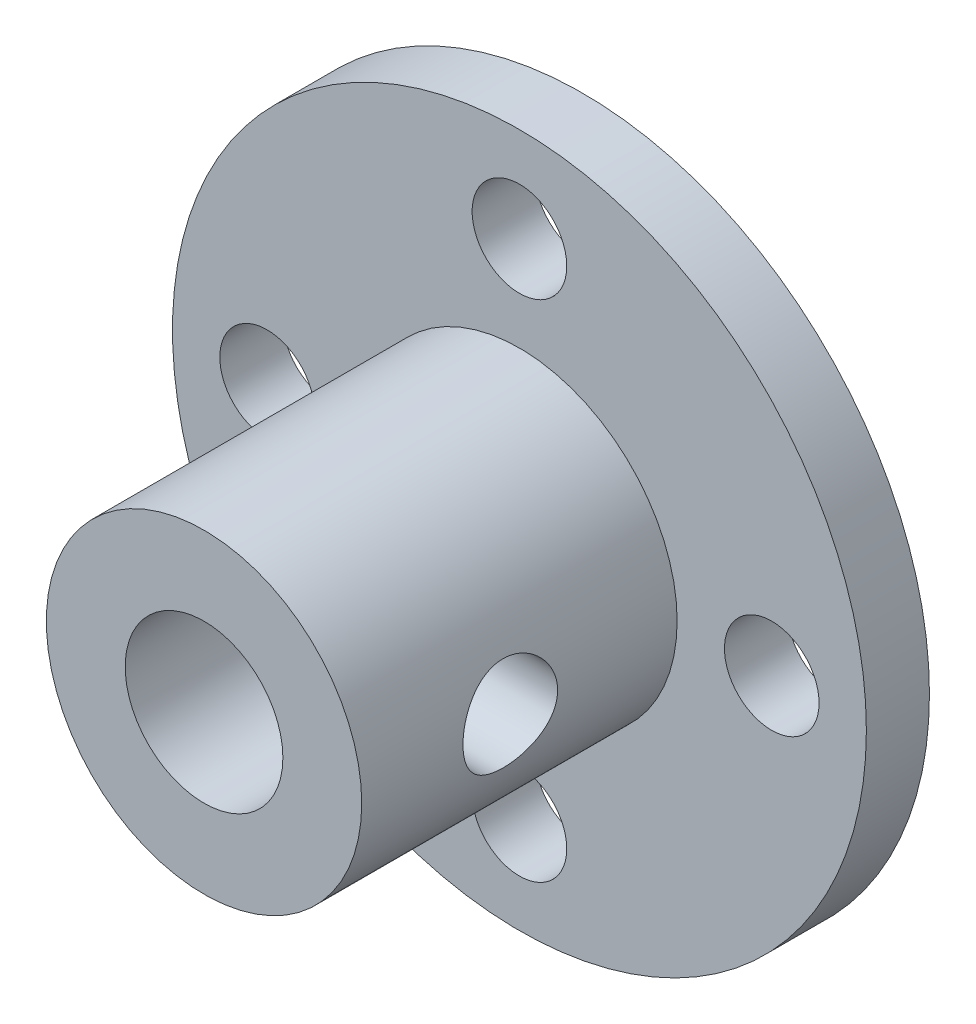
ISO-10303-21;
HEADER;
FILE_DESCRIPTION(('STEP AP214'),'2;1');
FILE_NAME('part.step','',(''),(''),'','','');
FILE_SCHEMA(('AUTOMOTIVE_DESIGN { 1 0 10303 214 1 1 1 1 }'));
ENDSEC;
DATA;
#1=APPLICATION_CONTEXT('core data for automotive mechanical design processes');
#2=APPLICATION_PROTOCOL_DEFINITION('international standard','automotive_design',2000,#1);
#3=PRODUCT_CONTEXT('',#1,'mechanical');
#4=PRODUCT('Part','Part','',(#3));
#5=PRODUCT_RELATED_PRODUCT_CATEGORY('part','',(#4));
#6=PRODUCT_DEFINITION_FORMATION('','',#4);
#7=PRODUCT_DEFINITION_CONTEXT('part definition',#1,'design');
#8=PRODUCT_DEFINITION('design','',#6,#7);
#9=PRODUCT_DEFINITION_SHAPE('','',#8);
#10=(LENGTH_UNIT() NAMED_UNIT(*) SI_UNIT(.MILLI.,.METRE.));
#11=(NAMED_UNIT(*) PLANE_ANGLE_UNIT() SI_UNIT($,.RADIAN.));
#12=(NAMED_UNIT(*) SI_UNIT($,.STERADIAN.) SOLID_ANGLE_UNIT());
#13=UNCERTAINTY_MEASURE_WITH_UNIT(LENGTH_MEASURE(1.E-05),#10,'distance_accuracy_value','');
#14=(GEOMETRIC_REPRESENTATION_CONTEXT(3) GLOBAL_UNCERTAINTY_ASSIGNED_CONTEXT((#13)) GLOBAL_UNIT_ASSIGNED_CONTEXT((#10,
#11,#12)) REPRESENTATION_CONTEXT('',''));
#15=CARTESIAN_POINT('',(0.,0.,0.));
#16=DIRECTION('',(0.,0.,1.));
#17=DIRECTION('',(1.,0.,0.));
#18=AXIS2_PLACEMENT_3D('',#15,#16,#17);
#19=CARTESIAN_POINT('',(0.,0.,2.));
#20=DIRECTION('',(0.,0.,-1.));
#21=DIRECTION('',(-1.,0.,0.));
#22=AXIS2_PLACEMENT_3D('',#19,#20,#21);
#23=CYLINDRICAL_SURFACE('',#22,11.);
#24=CARTESIAN_POINT('',(0.,0.,2.));
#25=DIRECTION('',(0.,0.,1.));
#26=DIRECTION('',(1.,0.,0.));
#27=AXIS2_PLACEMENT_3D('',#24,#25,#26);
#28=CIRCLE('',#27,11.);
#29=CARTESIAN_POINT('',(11.,0.,2.));
#30=VERTEX_POINT('',#29);
#31=EDGE_CURVE('E50',#30,#30,#28,.T.);
#32=ORIENTED_EDGE('',*,*,#31,.F.);
#33=EDGE_LOOP('',(#32));
#34=FACE_BOUND('',#33,.T.);
#35=CARTESIAN_POINT('',(0.,0.,0.));
#36=DIRECTION('',(0.,0.,1.));
#37=DIRECTION('',(1.,0.,0.));
#38=AXIS2_PLACEMENT_3D('',#35,#36,#37);
#39=CIRCLE('',#38,11.);
#40=CARTESIAN_POINT('',(11.,0.,0.));
#41=VERTEX_POINT('',#40);
#42=EDGE_CURVE('E56',#41,#41,#39,.T.);
#43=ORIENTED_EDGE('',*,*,#42,.T.);
#44=EDGE_LOOP('',(#43));
#45=FACE_BOUND('',#44,.T.);
#46=ADVANCED_FACE('F37',(#34,#45),#23,.T.);
#47=CARTESIAN_POINT('',(0.,0.,2.));
#48=DIRECTION('',(0.,0.,1.));
#49=DIRECTION('',(1.,0.,0.));
#50=AXIS2_PLACEMENT_3D('',#47,#48,#49);
#51=PLANE('',#50);
#52=CARTESIAN_POINT('',(0.,8.,2.));
#53=DIRECTION('',(0.,0.,1.));
#54=DIRECTION('',(1.,0.,0.));
#55=AXIS2_PLACEMENT_3D('',#52,#53,#54);
#56=CIRCLE('',#55,1.5);
#57=CARTESIAN_POINT('',(1.5,8.,2.));
#58=VERTEX_POINT('',#57);
#59=EDGE_CURVE('E163',#58,#58,#56,.T.);
#60=ORIENTED_EDGE('',*,*,#59,.F.);
#61=EDGE_LOOP('',(#60));
#62=FACE_BOUND('',#61,.T.);
#63=CARTESIAN_POINT('',(8.00000000000023,2.26393958003914E-13,2.));
#64=DIRECTION('',(0.,0.,1.));
#65=DIRECTION('',(1.,0.,0.));
#66=AXIS2_PLACEMENT_3D('',#63,#64,#65);
#67=CIRCLE('',#66,1.50000000000018);
#68=CARTESIAN_POINT('',(9.5000000000004,2.26393958003914E-13,2.));
#69=VERTEX_POINT('',#68);
#70=EDGE_CURVE('E155',#69,#69,#67,.T.);
#71=ORIENTED_EDGE('',*,*,#70,.F.);
#72=EDGE_LOOP('',(#71));
#73=FACE_BOUND('',#72,.T.);
#74=CARTESIAN_POINT('',(4.52787916007828E-13,-8.,2.));
#75=DIRECTION('',(0.,0.,1.));
#76=DIRECTION('',(1.,0.,0.));
#77=AXIS2_PLACEMENT_3D('',#74,#75,#76);
#78=CIRCLE('',#77,1.50000000000049);
#79=CARTESIAN_POINT('',(1.50000000000094,-8.,2.));
#80=VERTEX_POINT('',#79);
#81=EDGE_CURVE('E147',#80,#80,#78,.T.);
#82=ORIENTED_EDGE('',*,*,#81,.F.);
#83=EDGE_LOOP('',(#82));
#84=FACE_BOUND('',#83,.T.);
#85=CARTESIAN_POINT('',(-7.99999999999977,-2.27373675443232E-13,2.));
#86=DIRECTION('',(0.,0.,1.));
#87=DIRECTION('',(1.,0.,0.));
#88=AXIS2_PLACEMENT_3D('',#85,#86,#87);
#89=CIRCLE('',#88,1.50000000000036);
#90=CARTESIAN_POINT('',(-6.49999999999941,-2.27373675443232E-13,2.));
#91=VERTEX_POINT('',#90);
#92=EDGE_CURVE('E139',#91,#91,#89,.T.);
#93=ORIENTED_EDGE('',*,*,#92,.F.);
#94=EDGE_LOOP('',(#93));
#95=FACE_BOUND('',#94,.T.);
#96=CARTESIAN_POINT('',(0.,0.,2.));
#97=DIRECTION('',(0.,0.,1.));
#98=DIRECTION('',(1.,0.,0.));
#99=AXIS2_PLACEMENT_3D('',#96,#97,#98);
#100=CIRCLE('',#99,5.);
#101=CARTESIAN_POINT('',(5.,0.,2.));
#102=VERTEX_POINT('',#101);
#103=EDGE_CURVE('E127',#102,#102,#100,.T.);
#104=ORIENTED_EDGE('',*,*,#103,.F.);
#105=EDGE_LOOP('',(#104));
#106=FACE_BOUND('',#105,.T.);
#107=ORIENTED_EDGE('',*,*,#31,.T.);
#108=EDGE_LOOP('',(#107));
#109=FACE_BOUND('',#108,.T.);
#110=ADVANCED_FACE('F100',(#62,#73,#84,#95,#106,#109),#51,.T.);
#111=CARTESIAN_POINT('',(0.,0.,0.));
#112=DIRECTION('',(0.,0.,1.));
#113=DIRECTION('',(1.,0.,0.));
#114=AXIS2_PLACEMENT_3D('',#111,#112,#113);
#115=PLANE('',#114);
#116=CARTESIAN_POINT('',(0.,8.,0.));
#117=DIRECTION('',(0.,0.,1.));
#118=DIRECTION('',(1.,0.,0.));
#119=AXIS2_PLACEMENT_3D('',#116,#117,#118);
#120=CIRCLE('',#119,1.5);
#121=CARTESIAN_POINT('',(1.5,8.,0.));
#122=VERTEX_POINT('',#121);
#123=EDGE_CURVE('E138',#122,#122,#120,.T.);
#124=ORIENTED_EDGE('',*,*,#123,.T.);
#125=EDGE_LOOP('',(#124));
#126=FACE_BOUND('',#125,.T.);
#127=CARTESIAN_POINT('',(8.00000000000023,2.26393958003914E-13,0.));
#128=DIRECTION('',(0.,0.,1.));
#129=DIRECTION('',(1.,0.,0.));
#130=AXIS2_PLACEMENT_3D('',#127,#128,#129);
#131=CIRCLE('',#130,1.50000000000018);
#132=CARTESIAN_POINT('',(9.5000000000004,2.26393958003914E-13,0.));
#133=VERTEX_POINT('',#132);
#134=EDGE_CURVE('E159',#133,#133,#131,.T.);
#135=ORIENTED_EDGE('',*,*,#134,.T.);
#136=EDGE_LOOP('',(#135));
#137=FACE_BOUND('',#136,.T.);
#138=CARTESIAN_POINT('',(4.52787916007828E-13,-8.,0.));
#139=DIRECTION('',(0.,0.,1.));
#140=DIRECTION('',(1.,0.,0.));
#141=AXIS2_PLACEMENT_3D('',#138,#139,#140);
#142=CIRCLE('',#141,1.50000000000049);
#143=CARTESIAN_POINT('',(1.50000000000094,-8.,0.));
#144=VERTEX_POINT('',#143);
#145=EDGE_CURVE('E151',#144,#144,#142,.T.);
#146=ORIENTED_EDGE('',*,*,#145,.T.);
#147=EDGE_LOOP('',(#146));
#148=FACE_BOUND('',#147,.T.);
#149=CARTESIAN_POINT('',(-7.99999999999977,-2.27373675443232E-13,0.));
#150=DIRECTION('',(0.,0.,1.));
#151=DIRECTION('',(1.,0.,0.));
#152=AXIS2_PLACEMENT_3D('',#149,#150,#151);
#153=CIRCLE('',#152,1.50000000000036);
#154=CARTESIAN_POINT('',(-6.49999999999941,-2.27373675443232E-13,0.));
#155=VERTEX_POINT('',#154);
#156=EDGE_CURVE('E143',#155,#155,#153,.T.);
#157=ORIENTED_EDGE('',*,*,#156,.T.);
#158=EDGE_LOOP('',(#157));
#159=FACE_BOUND('',#158,.T.);
#160=ORIENTED_EDGE('',*,*,#42,.F.);
#161=EDGE_LOOP('',(#160));
#162=FACE_BOUND('',#161,.T.);
#163=ADVANCED_FACE('F103',(#126,#137,#148,#159,#162),#115,.F.);
#164=CARTESIAN_POINT('',(0.,0.,12.));
#165=DIRECTION('',(0.,0.,1.));
#166=DIRECTION('',(1.,0.,0.));
#167=AXIS2_PLACEMENT_3D('',#164,#165,#166);
#168=PLANE('',#167);
#169=CARTESIAN_POINT('',(0.,0.,12.));
#170=DIRECTION('',(0.,0.,1.));
#171=DIRECTION('',(1.,0.,0.));
#172=AXIS2_PLACEMENT_3D('',#169,#170,#171);
#173=CIRCLE('',#172,5.);
#174=CARTESIAN_POINT('',(5.,0.,12.));
#175=VERTEX_POINT('',#174);
#176=EDGE_CURVE('E124',#175,#175,#173,.T.);
#177=ORIENTED_EDGE('',*,*,#176,.T.);
#178=EDGE_LOOP('',(#177));
#179=FACE_BOUND('',#178,.T.);
#180=CARTESIAN_POINT('',(0.,0.,12.));
#181=DIRECTION('',(0.,0.,1.));
#182=DIRECTION('',(1.,0.,0.));
#183=AXIS2_PLACEMENT_3D('',#180,#181,#182);
#184=CIRCLE('',#183,2.5);
#185=CARTESIAN_POINT('',(2.5,0.,12.));
#186=VERTEX_POINT('',#185);
#187=EDGE_CURVE('E132',#186,#186,#184,.T.);
#188=ORIENTED_EDGE('',*,*,#187,.F.);
#189=EDGE_LOOP('',(#188));
#190=FACE_BOUND('',#189,.T.);
#191=ADVANCED_FACE('F98',(#179,#190),#168,.T.);
#192=CARTESIAN_POINT('',(0.,0.,12.));
#193=DIRECTION('',(0.,0.,-1.));
#194=DIRECTION('',(-1.,0.,0.));
#195=AXIS2_PLACEMENT_3D('',#192,#193,#194);
#196=CYLINDRICAL_SURFACE('',#195,5.);
#197=CARTESIAN_POINT('',(-5.,0.,8.78960798056651));
#198=CARTESIAN_POINT('',(-4.9999992925055,-0.0822886127532999,8.78960698308162));
#199=CARTESIAN_POINT('',(-4.99794915693953,-0.164587318351529,8.78281411694254));
#200=CARTESIAN_POINT('',(-4.98997105593691,-0.326788125304881,8.75588662634441));
#201=CARTESIAN_POINT('',(-4.98404193389692,-0.40668950441142,8.73574802254317));
#202=CARTESIAN_POINT('',(-4.96895552501836,-0.561732707754526,8.68286196365625));
#203=CARTESIAN_POINT('',(-4.95980300250425,-0.636881364395373,8.65013311094757));
#204=CARTESIAN_POINT('',(-4.93922109237645,-0.780624181053131,8.57307188751067));
#205=CARTESIAN_POINT('',(-4.92779140192067,-0.849217467469669,8.52873797317109));
#206=CARTESIAN_POINT('',(-4.90350737192774,-0.979871797183745,8.42838397309384));
#207=CARTESIAN_POINT('',(-4.89062383657036,-1.04171807124434,8.3720913546806));
#208=CARTESIAN_POINT('',(-4.86505834210442,-1.15524920923324,8.24999875065633));
#209=CARTESIAN_POINT('',(-4.85237641724501,-1.20693236327441,8.18419716844155));
#210=CARTESIAN_POINT('',(-4.82834113993772,-1.29980037723708,8.0431372275289));
#211=CARTESIAN_POINT('',(-4.81702406663875,-1.34072309022213,7.96769951957577));
#212=CARTESIAN_POINT('',(-4.79743620394031,-1.4092139477476,7.81061872633622));
#213=CARTESIAN_POINT('',(-4.78916468313311,-1.43678529919973,7.72897713663853));
#214=CARTESIAN_POINT('',(-4.77690870838434,-1.47701633682652,7.56421771443605));
#215=CARTESIAN_POINT('',(-4.77281069324533,-1.49007196234677,7.48120523670257));
#216=CARTESIAN_POINT('',(-4.76902789749767,-1.50213730614672,7.31407482434974));
#217=CARTESIAN_POINT('',(-4.76934204760571,-1.50115042761078,7.22995716250742));
#218=CARTESIAN_POINT('',(-4.77424744067778,-1.48546977199812,7.06622407195803));
#219=CARTESIAN_POINT('',(-4.77868388599141,-1.47127205262685,6.98655573020427));
#220=CARTESIAN_POINT('',(-4.79108356228624,-1.43037420427056,6.83078819429305));
#221=CARTESIAN_POINT('',(-4.7990471413235,-1.40367284141641,6.75468935319218));
#222=CARTESIAN_POINT('',(-4.81772733074973,-1.33816026653682,6.60700763090577));
#223=CARTESIAN_POINT('',(-4.82848016115952,-1.29918816934642,6.53550089661125));
#224=CARTESIAN_POINT('',(-4.85150987000064,-1.21035222588683,6.39987595855632));
#225=CARTESIAN_POINT('',(-4.86378711746991,-1.16048574002588,6.33575955115273));
#226=CARTESIAN_POINT('',(-4.88911011297937,-1.04881290765546,6.21392178980449));
#227=CARTESIAN_POINT('',(-4.90216654310498,-0.986594907466972,6.15657931653684));
#228=CARTESIAN_POINT('',(-4.92712244063258,-0.853263259313967,6.05305399650226));
#229=CARTESIAN_POINT('',(-4.9390218351841,-0.782149051860887,6.00687185215208));
#230=CARTESIAN_POINT('',(-4.9604316006947,-0.632355038342803,5.92674805810178));
#231=CARTESIAN_POINT('',(-4.96992543668314,-0.55362774974795,5.89289046431665));
#232=CARTESIAN_POINT('',(-4.98533521832222,-0.391245415603519,5.83900839046688));
#233=CARTESIAN_POINT('',(-4.99125216186999,-0.307591751589581,5.81898005203402));
#234=CARTESIAN_POINT('',(-4.99868364643538,-0.140952242668331,5.79395580266712));
#235=CARTESIAN_POINT('',(-5.0003485041779,-0.0580500976011866,5.7884463947649));
#236=CARTESIAN_POINT('',(-4.99952923241759,0.107499605823383,5.79117713627859));
#237=CARTESIAN_POINT('',(-4.99704565677756,0.190147196690781,5.79941545021795));
#238=CARTESIAN_POINT('',(-4.98830696987163,0.350903605309697,5.82899259167801));
#239=CARTESIAN_POINT('',(-4.98213829799417,0.42907277261417,5.85003136814738));
#240=CARTESIAN_POINT('',(-4.96674347841532,0.580754638954523,5.90425121334471));
#241=CARTESIAN_POINT('',(-4.95751696321085,0.654266777025584,5.93743374160437));
#242=CARTESIAN_POINT('',(-4.93669654351325,0.796437189461053,6.01586114604764));
#243=CARTESIAN_POINT('',(-4.92505280829675,0.86494382619967,6.06136732151448));
#244=CARTESIAN_POINT('',(-4.90073468764317,0.993523307980147,6.16283273461932));
#245=CARTESIAN_POINT('',(-4.8880600443108,1.05359403235593,6.21879459245418));
#246=CARTESIAN_POINT('',(-4.86253171869138,1.16585744551027,6.34199528893586));
#247=CARTESIAN_POINT('',(-4.84968825033268,1.21768481231503,6.40956985633825));
#248=CARTESIAN_POINT('',(-4.82576515238463,1.30928995072154,6.55273591958004));
#249=CARTESIAN_POINT('',(-4.81468547654651,1.34906803829472,6.62832720512472));
#250=CARTESIAN_POINT('',(-4.79567189615055,1.41517347127168,6.7851404718212));
#251=CARTESIAN_POINT('',(-4.78772337843827,1.4415634693705,6.8663341671031));
#252=CARTESIAN_POINT('',(-4.77591594362794,1.48021730815114,7.03229594949799));
#253=CARTESIAN_POINT('',(-4.772055625083,1.49248598978779,7.11706280135418));
#254=CARTESIAN_POINT('',(-4.76899972496087,1.50221984485059,7.28396949894274));
#255=CARTESIAN_POINT('',(-4.76961647442754,1.5002805530849,7.3660716315841));
#256=CARTESIAN_POINT('',(-4.77499401288294,1.48307505444813,7.52872208393931));
#257=CARTESIAN_POINT('',(-4.77975463592551,1.46780938124716,7.60927046574286));
#258=CARTESIAN_POINT('',(-4.79275763670385,1.42476888804136,7.76555337970936));
#259=CARTESIAN_POINT('',(-4.80095604545965,1.39715175507068,7.8413352679282));
#260=CARTESIAN_POINT('',(-4.81990278909136,1.33031507121129,7.98725041938423));
#261=CARTESIAN_POINT('',(-4.83065161194312,1.29109329962876,8.05738259820727));
#262=CARTESIAN_POINT('',(-4.85397676425833,1.20048763805072,8.19277109709362));
#263=CARTESIAN_POINT('',(-4.86660540163797,1.14871276092994,8.25775674182692));
#264=CARTESIAN_POINT('',(-4.89201320450026,1.03517434629782,8.37831047887437));
#265=CARTESIAN_POINT('',(-4.90479240823905,0.973408217134501,8.43387612003426));
#266=CARTESIAN_POINT('',(-4.92950936570649,0.839465762183248,8.53563139286154));
#267=CARTESIAN_POINT('',(-4.94141159765674,0.767037885790608,8.581499427422));
#268=CARTESIAN_POINT('',(-4.96260680455813,0.61514137398353,8.66034315047053));
#269=CARTESIAN_POINT('',(-4.97190099931066,0.535676052998955,8.69332486884102));
#270=CARTESIAN_POINT('',(-4.98602174969301,0.380757712655282,8.74250325621926));
#271=CARTESIAN_POINT('',(-4.99122027381067,0.305786961954234,8.76011965344976));
#272=CARTESIAN_POINT('',(-4.99820944494492,0.153880195230779,8.78367150580809));
#273=CARTESIAN_POINT('',(-5.0000006615474,0.0769445098581396,8.78960891327133));
#274=CARTESIAN_POINT('',(-5.,0.,8.78960798056651));
#275=B_SPLINE_CURVE_WITH_KNOTS('',3,(#197,#198,#199,#200,#201,#202,#203,#204,#205,#206,#207,
#208,#209,#210,#211,#212,#213,#214,#215,#216,#217,#218,#219,#220,#221,#222,#223,#224,#225,#226,
#227,#228,#229,#230,#231,#232,#233,#234,#235,#236,#237,#238,#239,#240,#241,#242,#243,#244,#245,
#246,#247,#248,#249,#250,#251,#252,#253,#254,#255,#256,#257,#258,#259,#260,#261,#262,#263,#264,
#265,#266,#267,#268,#269,#270,#271,#272,#273,#274),.UNSPECIFIED.,.T.,.F.,(4,2,2,2,2,2,2,2,2,2,2,
2,2,2,2,2,2,2,2,2,2,2,2,2,2,2,2,2,2,2,2,2,2,2,2,2,2,2,4),(0.,0.24658320361261,0.493239964845999,
0.739533676300874,0.985860164412702,1.23855602948191,1.49129437288633,1.74971481004109,
2.00807314543224,2.25919689356599,2.51025978319089,2.75226016697676,2.99428443658001,
3.23962426447119,3.48502360158555,3.74067104048166,3.99633456531071,4.25371046881688,
4.51101453528808,4.75908809438545,5.00712853550327,5.24956746682327,5.49203554593728,
5.74011305702908,5.98825282000191,6.24540400322818,6.5025484425268,6.75847814951251,
7.01432009460283,7.25950155466942,7.50467319661599,7.74680040402721,7.98897397553107,
8.2399692567993,8.49102974897502,8.7494299615667,9.00770911595235,9.23831691930459,
9.46888616948874),.UNSPECIFIED.);
#276=CARTESIAN_POINT('',(-5.,0.,8.78960798056651));
#277=VERTEX_POINT('',#276);
#278=EDGE_CURVE('E89',#277,#277,#275,.T.);
#279=ORIENTED_EDGE('',*,*,#278,.T.);
#280=EDGE_LOOP('',(#279));
#281=FACE_BOUND('',#280,.T.);
#282=CARTESIAN_POINT('',(5.,0.,5.78960798056651));
#283=CARTESIAN_POINT('',(4.9999992925055,-0.0822886127532998,5.7896089780514));
#284=CARTESIAN_POINT('',(4.99794915693953,-0.164587318351529,5.79640184419048));
#285=CARTESIAN_POINT('',(4.98997105593691,-0.32678812530488,5.82332933478861));
#286=CARTESIAN_POINT('',(4.98404193389692,-0.40668950441142,5.84346793858985));
#287=CARTESIAN_POINT('',(4.96895552501836,-0.561732707754526,5.89635399747677));
#288=CARTESIAN_POINT('',(4.95980300250425,-0.636881364395373,5.92908285018545));
#289=CARTESIAN_POINT('',(4.93922109237645,-0.780624181053131,6.00614407362235));
#290=CARTESIAN_POINT('',(4.92779140192067,-0.849217467469669,6.05047798796193));
#291=CARTESIAN_POINT('',(4.90350737192774,-0.979871797183745,6.15083198803918));
#292=CARTESIAN_POINT('',(4.89062383657036,-1.04171807124434,6.20712460645242));
#293=CARTESIAN_POINT('',(4.86505834210442,-1.15524920923324,6.32921721047669));
#294=CARTESIAN_POINT('',(4.85237641724501,-1.20693236327441,6.39501879269147));
#295=CARTESIAN_POINT('',(4.82834113993772,-1.29980037723708,6.53607873360412));
#296=CARTESIAN_POINT('',(4.81702406663875,-1.34072309022213,6.61151644155725));
#297=CARTESIAN_POINT('',(4.79743620394031,-1.4092139477476,6.7685972347968));
#298=CARTESIAN_POINT('',(4.78916468313311,-1.43678529919973,6.85023882449449));
#299=CARTESIAN_POINT('',(4.77690870838434,-1.47701633682652,7.01499824669697));
#300=CARTESIAN_POINT('',(4.77281069324533,-1.49007196234677,7.09801072443045));
#301=CARTESIAN_POINT('',(4.76902789749767,-1.50213730614672,7.26514113678328));
#302=CARTESIAN_POINT('',(4.76934204760571,-1.50115042761078,7.3492587986256));
#303=CARTESIAN_POINT('',(4.77424744067778,-1.48546977199812,7.51299188917499));
#304=CARTESIAN_POINT('',(4.7786838859914,-1.47127205262685,7.59266023092875));
#305=CARTESIAN_POINT('',(4.79108356228624,-1.43037420427056,7.74842776683997));
#306=CARTESIAN_POINT('',(4.7990471413235,-1.40367284141641,7.82452660794084));
#307=CARTESIAN_POINT('',(4.81772733074973,-1.33816026653682,7.97220833022725));
#308=CARTESIAN_POINT('',(4.82848016115952,-1.29918816934643,8.04371506452177));
#309=CARTESIAN_POINT('',(4.85150987000064,-1.21035222588683,8.1793400025767));
#310=CARTESIAN_POINT('',(4.86378711746991,-1.16048574002588,8.24345640998029));
#311=CARTESIAN_POINT('',(4.88911011297937,-1.04881290765546,8.36529417132853));
#312=CARTESIAN_POINT('',(4.90216654310498,-0.986594907466972,8.42263664459618));
#313=CARTESIAN_POINT('',(4.92712244063258,-0.853263259313967,8.52616196463076));
#314=CARTESIAN_POINT('',(4.9390218351841,-0.782149051860888,8.57234410898094));
#315=CARTESIAN_POINT('',(4.9604316006947,-0.632355038342803,8.65246790303124));
#316=CARTESIAN_POINT('',(4.96992543668314,-0.55362774974795,8.68632549681637));
#317=CARTESIAN_POINT('',(4.98533521832222,-0.391245415603519,8.74020757066614));
#318=CARTESIAN_POINT('',(4.99125216186999,-0.307591751589581,8.760235909099));
#319=CARTESIAN_POINT('',(4.99868364643538,-0.140952242668331,8.7852601584659));
#320=CARTESIAN_POINT('',(5.0003485041779,-0.0580500976011862,8.79076956636812));
#321=CARTESIAN_POINT('',(4.99952923241759,0.107499605823384,8.78803882485443));
#322=CARTESIAN_POINT('',(4.99704565677756,0.190147196690781,8.77980051091507));
#323=CARTESIAN_POINT('',(4.98830696987163,0.350903605309698,8.75022336945501));
#324=CARTESIAN_POINT('',(4.98213829799417,0.42907277261417,8.72918459298564));
#325=CARTESIAN_POINT('',(4.96674347841532,0.580754638954522,8.67496474778831));
#326=CARTESIAN_POINT('',(4.95751696321085,0.654266777025584,8.64178221952865));
#327=CARTESIAN_POINT('',(4.93669654351325,0.796437189461052,8.56335481508538));
#328=CARTESIAN_POINT('',(4.92505280829675,0.86494382619967,8.51784863961854));
#329=CARTESIAN_POINT('',(4.90073468764317,0.993523307980147,8.4163832265137));
#330=CARTESIAN_POINT('',(4.8880600443108,1.05359403235593,8.36042136867884));
#331=CARTESIAN_POINT('',(4.86253171869138,1.16585744551027,8.23722067219716));
#332=CARTESIAN_POINT('',(4.84968825033268,1.21768481231503,8.16964610479477));
#333=CARTESIAN_POINT('',(4.82576515238463,1.30928995072153,8.02648004155298));
#334=CARTESIAN_POINT('',(4.81468547654651,1.34906803829472,7.9508887560083));
#335=CARTESIAN_POINT('',(4.79567189615055,1.41517347127168,7.79407548931182));
#336=CARTESIAN_POINT('',(4.78772337843827,1.4415634693705,7.71288179402992));
#337=CARTESIAN_POINT('',(4.77591594362794,1.48021730815114,7.54692001163503));
#338=CARTESIAN_POINT('',(4.772055625083,1.49248598978779,7.46215315977884));
#339=CARTESIAN_POINT('',(4.76899972496087,1.50221984485059,7.29524646219028));
#340=CARTESIAN_POINT('',(4.76961647442754,1.5002805530849,7.21314432954892));
#341=CARTESIAN_POINT('',(4.77499401288294,1.48307505444813,7.05049387719371));
#342=CARTESIAN_POINT('',(4.77975463592551,1.46780938124716,6.96994549539016));
#343=CARTESIAN_POINT('',(4.79275763670386,1.42476888804136,6.81366258142366));
#344=CARTESIAN_POINT('',(4.80095604545965,1.39715175507068,6.73788069320482));
#345=CARTESIAN_POINT('',(4.81990278909136,1.33031507121129,6.59196554174879));
#346=CARTESIAN_POINT('',(4.83065161194312,1.29109329962876,6.52183336292575));
#347=CARTESIAN_POINT('',(4.85397676425833,1.20048763805072,6.3864448640394));
#348=CARTESIAN_POINT('',(4.86660540163797,1.14871276092994,6.3214592193061));
#349=CARTESIAN_POINT('',(4.89201320450026,1.03517434629782,6.20090548225865));
#350=CARTESIAN_POINT('',(4.90479240823905,0.9734082171345,6.14533984109875));
#351=CARTESIAN_POINT('',(4.92950936570649,0.839465762183247,6.04358456827148));
#352=CARTESIAN_POINT('',(4.94141159765674,0.767037885790607,5.99771653371102));
#353=CARTESIAN_POINT('',(4.96260680455813,0.615141373983528,5.91887281066249));
#354=CARTESIAN_POINT('',(4.97190099931066,0.535676052998954,5.885891092292));
#355=CARTESIAN_POINT('',(4.98602174969301,0.380757712655281,5.83671270491376));
#356=CARTESIAN_POINT('',(4.99122027381067,0.305786961954234,5.81909630768326));
#357=CARTESIAN_POINT('',(4.99820944494492,0.15388019523078,5.79554445532493));
#358=CARTESIAN_POINT('',(5.0000006615474,0.0769445098581397,5.78960704786169));
#359=CARTESIAN_POINT('',(5.,0.,5.78960798056651));
#360=B_SPLINE_CURVE_WITH_KNOTS('',3,(#282,#283,#284,#285,#286,#287,#288,#289,#290,#291,#292,
#293,#294,#295,#296,#297,#298,#299,#300,#301,#302,#303,#304,#305,#306,#307,#308,#309,#310,#311,
#312,#313,#314,#315,#316,#317,#318,#319,#320,#321,#322,#323,#324,#325,#326,#327,#328,#329,#330,
#331,#332,#333,#334,#335,#336,#337,#338,#339,#340,#341,#342,#343,#344,#345,#346,#347,#348,#349,
#350,#351,#352,#353,#354,#355,#356,#357,#358,#359),.UNSPECIFIED.,.T.,.F.,(4,2,2,2,2,2,2,2,2,2,2,
2,2,2,2,2,2,2,2,2,2,2,2,2,2,2,2,2,2,2,2,2,2,2,2,2,2,2,4),(0.,0.24658320361261,0.493239964845999,
0.739533676300874,0.985860164412701,1.23855602948191,1.49129437288633,1.74971481004109,
2.00807314543224,2.25919689356599,2.51025978319089,2.75226016697676,2.99428443658001,
3.23962426447119,3.48502360158555,3.74067104048166,3.99633456531071,4.25371046881688,
4.51101453528807,4.75908809438545,5.00712853550327,5.24956746682327,5.49203554593728,
5.74011305702908,5.98825282000191,6.24540400322818,6.5025484425268,6.75847814951251,
7.01432009460283,7.25950155466942,7.50467319661599,7.74680040402721,7.98897397553107,
8.2399692567993,8.49102974897502,8.7494299615667,9.00770911595235,9.23831691930459,
9.46888616948874),.UNSPECIFIED.);
#361=CARTESIAN_POINT('',(5.,0.,5.78960798056651));
#362=VERTEX_POINT('',#361);
#363=EDGE_CURVE('E82',#362,#362,#360,.T.);
#364=ORIENTED_EDGE('',*,*,#363,.T.);
#365=EDGE_LOOP('',(#364));
#366=FACE_BOUND('',#365,.T.);
#367=ORIENTED_EDGE('',*,*,#176,.F.);
#368=EDGE_LOOP('',(#367));
#369=FACE_BOUND('',#368,.T.);
#370=ORIENTED_EDGE('',*,*,#103,.T.);
#371=EDGE_LOOP('',(#370));
#372=FACE_BOUND('',#371,.T.);
#373=ADVANCED_FACE('F94',(#281,#366,#369,#372),#196,.T.);
#374=CARTESIAN_POINT('',(0.,0.,12.));
#375=DIRECTION('',(0.,0.,-1.));
#376=DIRECTION('',(-1.,0.,0.));
#377=AXIS2_PLACEMENT_3D('',#374,#375,#376);
#378=CYLINDRICAL_SURFACE('',#377,2.5);
#379=CARTESIAN_POINT('',(-2.5,0.,8.78960798056651));
#380=CARTESIAN_POINT('',(-2.49999625789732,-0.0767298334620157,8.78960388955663));
#381=CARTESIAN_POINT('',(-2.4964290461501,-0.153582320644178,8.78367930964025));
#382=CARTESIAN_POINT('',(-2.48249903608568,-0.304975509530679,8.76028366105118));
#383=CARTESIAN_POINT('',(-2.47211948032719,-0.379510034596047,8.74278411871229));
#384=CARTESIAN_POINT('',(-2.44561558054488,-0.523751827790837,8.69722161939965));
#385=CARTESIAN_POINT('',(-2.42951973272944,-0.593481028226566,8.66921102240335));
#386=CARTESIAN_POINT('',(-2.39295367626407,-0.727030318214658,8.60374764742548));
#387=CARTESIAN_POINT('',(-2.37248455380255,-0.790851869416383,8.56629721359777));
#388=CARTESIAN_POINT('',(-2.32705360719088,-0.916299278999314,8.47983315385793));
#389=CARTESIAN_POINT('',(-2.30186792195985,-0.977384020081415,8.43015428521512));
#390=CARTESIAN_POINT('',(-2.25030439279634,-1.09088270411891,8.32214077673824));
#391=CARTESIAN_POINT('',(-2.22392505153571,-1.14328534948112,8.26379504337919));
#392=CARTESIAN_POINT('',(-2.1691106699591,-1.24444996762974,8.13168447006978));
#393=CARTESIAN_POINT('',(-2.14082017703649,-1.29197766378809,8.05690620958522));
#394=CARTESIAN_POINT('',(-2.08938301412124,-1.37361437764896,7.8987614073234));
#395=CARTESIAN_POINT('',(-2.06622802273938,-1.4077451733516,7.81540908431894));
#396=CARTESIAN_POINT('',(-2.0335462966093,-1.45440601714221,7.66301152991327));
#397=CARTESIAN_POINT('',(-2.02207883137591,-1.47016197246826,7.59537198195619));
#398=CARTESIAN_POINT('',(-2.00590308295503,-1.49216172340475,7.45780426473614));
#399=CARTESIAN_POINT('',(-2.0011863964376,-1.49841734556836,7.38787905181201));
#400=CARTESIAN_POINT('',(-1.99920922463856,-1.50105508796009,7.24759648634917));
#401=CARTESIAN_POINT('',(-2.00196337012718,-1.49741783408418,7.17723855547331));
#402=CARTESIAN_POINT('',(-2.01453261443741,-1.48046060478828,7.03832920513892));
#403=CARTESIAN_POINT('',(-2.02435302432226,-1.46713334620103,6.96977918471906));
#404=CARTESIAN_POINT('',(-2.04953186944258,-1.43173921881792,6.8370777384384));
#405=CARTESIAN_POINT('',(-2.06481711652537,-1.40978748666087,6.77288092664203));
#406=CARTESIAN_POINT('',(-2.09927051350828,-1.35795061770837,6.64891298963838));
#407=CARTESIAN_POINT('',(-2.11844008623465,-1.32806257259705,6.58914349714258));
#408=CARTESIAN_POINT('',(-2.16255327268985,-1.25517983184583,6.4646238834437));
#409=CARTESIAN_POINT('',(-2.18792043372992,-1.21080724397723,6.40082988761158));
#410=CARTESIAN_POINT('',(-2.23930599764381,-1.11291092784003,6.28093149689949));
#411=CARTESIAN_POINT('',(-2.26532500262149,-1.05937845100578,6.22483454659));
#412=CARTESIAN_POINT('',(-2.31935504958317,-0.935811834382962,6.11399499874475));
#413=CARTESIAN_POINT('',(-2.34713836268533,-0.864517682704953,6.06053067455052));
#414=CARTESIAN_POINT('',(-2.39772428433981,-0.712276050458996,5.9664859333686));
#415=CARTESIAN_POINT('',(-2.42052955425515,-0.63133376394356,5.92589862677656));
#416=CARTESIAN_POINT('',(-2.45730392066151,-0.467197585268203,5.86167579777061));
#417=CARTESIAN_POINT('',(-2.47173957439704,-0.384467624173577,5.8371326248506));
#418=CARTESIAN_POINT('',(-2.49218842813551,-0.215047895144637,5.80259678316113));
#419=CARTESIAN_POINT('',(-2.49821172952738,-0.128363005661316,5.79258666281293));
#420=CARTESIAN_POINT('',(-2.5009057037461,0.0337146143773992,5.7881001328882));
#421=CARTESIAN_POINT('',(-2.49873521714286,0.109042473418721,5.79169912548134));
#422=CARTESIAN_POINT('',(-2.48778712087048,0.257829401986063,5.81003383363843));
#423=CARTESIAN_POINT('',(-2.47900964518037,0.331288509376108,5.82476932337232));
#424=CARTESIAN_POINT('',(-2.4559479244219,0.472574932157615,5.86415141337897));
#425=CARTESIAN_POINT('',(-2.44180275662555,0.540495750928485,5.88854832963998));
#426=CARTESIAN_POINT('',(-2.40913880862844,0.671265749087264,5.94628535693178));
#427=CARTESIAN_POINT('',(-2.39061916586511,0.73411392496391,5.97962723191318));
#428=CARTESIAN_POINT('',(-2.3484549623736,0.860006262823866,6.05816495977522));
#429=CARTESIAN_POINT('',(-2.3244780273988,0.922394150456839,6.10423180964491));
#430=CARTESIAN_POINT('',(-2.27474265574731,1.03902603131014,6.20499937405513));
#431=CARTESIAN_POINT('',(-2.2489821658636,1.09326040273738,6.25971013541905));
#432=CARTESIAN_POINT('',(-2.19445423909891,1.19931996735579,6.38451837060367));
#433=CARTESIAN_POINT('',(-2.16573241746291,1.24991019630915,6.45569186603202));
#434=CARTESIAN_POINT('',(-2.1121618206671,1.33845238915668,6.60682400513472));
#435=CARTESIAN_POINT('',(-2.0873089799769,1.37641766769781,6.6867732744593));
#436=CARTESIAN_POINT('',(-2.04984909240519,1.43142578795776,6.8358510028732));
#437=CARTESIAN_POINT('',(-2.03575659328729,1.4512162533619,6.9035882929251));
#438=CARTESIAN_POINT('',(-2.01409605743544,1.48113663905972,7.04214005864662));
#439=CARTESIAN_POINT('',(-2.00651897642721,1.49127995297631,7.11295012489434));
#440=CARTESIAN_POINT('',(-1.99900446616268,1.50134130416631,7.25598492816354));
#441=CARTESIAN_POINT('',(-1.99909576445937,1.50122089107869,7.32821397125356));
#442=CARTESIAN_POINT('',(-2.0069771789285,1.49066472959328,7.47150241617597));
#443=CARTESIAN_POINT('',(-2.0147714813882,1.48022337215759,7.54256116064711));
#444=CARTESIAN_POINT('',(-2.0363318524298,1.45040174148913,7.6780963981387));
#445=CARTESIAN_POINT('',(-2.04979211805581,1.43147636845351,7.74272507487338));
#446=CARTESIAN_POINT('',(-2.08105501960152,1.38563242076993,7.86794523504073));
#447=CARTESIAN_POINT('',(-2.09885929040482,1.35871083588479,7.92853518752707));
#448=CARTESIAN_POINT('',(-2.14012990550917,1.29289245555732,8.05392783778729));
#449=CARTESIAN_POINT('',(-2.1640458758264,1.25279167675753,8.11794908442082));
#450=CARTESIAN_POINT('',(-2.21320127030768,1.16375698389084,8.2389880531838));
#451=CARTESIAN_POINT('',(-2.23844177205021,1.11481579607798,8.29599994271907));
#452=CARTESIAN_POINT('',(-2.29225690291476,1.00009777425734,8.41095892969818));
#453=CARTESIAN_POINT('',(-2.32070308663658,0.932876819313902,8.4675390554627));
#454=CARTESIAN_POINT('',(-2.37365428872367,0.788462434445586,8.56870583642982));
#455=CARTESIAN_POINT('',(-2.39815789310936,0.711265444501537,8.6132881925513));
#456=CARTESIAN_POINT('',(-2.43985578654394,0.55112523080145,8.68739378814025));
#457=CARTESIAN_POINT('',(-2.45725077479787,0.468430086957211,8.71733604549334));
#458=CARTESIAN_POINT('',(-2.48366273001246,0.297973306118804,8.76233267577749));
#459=CARTESIAN_POINT('',(-2.49271125871485,0.210232099648609,8.7774431484235));
#460=CARTESIAN_POINT('',(-2.49802001168187,0.101558096917533,8.78630543527517));
#461=CARTESIAN_POINT('',(-2.49876114656362,0.0812762590282753,8.78754239787261));
#462=CARTESIAN_POINT('',(-2.49975164517367,0.0406658206871113,8.78919422693737));
#463=CARTESIAN_POINT('',(-2.50000099184316,0.0203372186375689,8.78960906488741));
#464=CARTESIAN_POINT('',(-2.5,0.,8.78960798056651));
#465=B_SPLINE_CURVE_WITH_KNOTS('',3,(#379,#380,#381,#382,#383,#384,#385,#386,#387,#388,#389,
#390,#391,#392,#393,#394,#395,#396,#397,#398,#399,#400,#401,#402,#403,#404,#405,#406,#407,#408,
#409,#410,#411,#412,#413,#414,#415,#416,#417,#418,#419,#420,#421,#422,#423,#424,#425,#426,#427,
#428,#429,#430,#431,#432,#433,#434,#435,#436,#437,#438,#439,#440,#441,#442,#443,#444,#445,#446,
#447,#448,#449,#450,#451,#452,#453,#454,#455,#456,#457,#458,#459,#460,#461,#462,#463,#464),
.UNSPECIFIED.,.T.,.F.,(4,2,2,2,2,2,2,2,2,2,2,2,2,2,2,2,2,2,2,2,2,2,2,2,2,2,2,2,2,2,2,2,2,2,2,2,
2,2,2,2,2,2,4),(0.,0.230102237548649,0.460772627520012,0.690308884600012,0.919788197992273,
1.16681590732472,1.414162579348,1.69183813189807,1.96906040692092,2.17933829855633,
2.38935420916578,2.59978170870726,2.81036753273872,3.01823267593207,3.22617409809868,
3.47046995225163,3.71500044803674,3.99360957884691,4.27206939275324,4.53296790696559,
4.79355286918236,5.01875602722426,5.24395461863455,5.46367785689772,5.68344445659025,
5.92601365818362,6.16886690081836,6.44336762428009,6.71757792616456,6.93257787314692,
7.14727888733318,7.36278425777433,7.57840681155725,7.78364098331142,7.98895251523035,
8.22578610052286,8.46281544370208,8.73854311775519,9.01436946031985,9.28175654462677,
9.54812832184448,9.60911473335177,9.6701032602764),.UNSPECIFIED.);
#466=CARTESIAN_POINT('',(-2.5,0.,8.78960798056651));
#467=VERTEX_POINT('',#466);
#468=EDGE_CURVE('E40',#467,#467,#465,.T.);
#469=ORIENTED_EDGE('',*,*,#468,.F.);
#470=EDGE_LOOP('',(#469));
#471=FACE_BOUND('',#470,.T.);
#472=CARTESIAN_POINT('',(2.5,0.,5.78960798056651));
#473=CARTESIAN_POINT('',(2.49999625789732,-0.0767298334620158,5.78961207157639));
#474=CARTESIAN_POINT('',(2.4964290461501,-0.153582320644178,5.79553665149278));
#475=CARTESIAN_POINT('',(2.48249903608568,-0.304975509530679,5.81893230008184));
#476=CARTESIAN_POINT('',(2.47211948032719,-0.379510034596047,5.83643184242074));
#477=CARTESIAN_POINT('',(2.44561558054488,-0.523751827790836,5.88199434173337));
#478=CARTESIAN_POINT('',(2.42951973272944,-0.593481028226565,5.91000493872967));
#479=CARTESIAN_POINT('',(2.39295367626407,-0.727030318214658,5.97546831370754));
#480=CARTESIAN_POINT('',(2.37248455380255,-0.790851869416383,6.01291874753526));
#481=CARTESIAN_POINT('',(2.32705360719088,-0.916299278999314,6.09938280727509));
#482=CARTESIAN_POINT('',(2.30186792195985,-0.977384020081415,6.1490616759179));
#483=CARTESIAN_POINT('',(2.25030439279634,-1.09088270411891,6.25707518439478));
#484=CARTESIAN_POINT('',(2.22392505153571,-1.14328534948112,6.31542091775383));
#485=CARTESIAN_POINT('',(2.1691106699591,-1.24444996762974,6.44753149106324));
#486=CARTESIAN_POINT('',(2.14082017703649,-1.29197766378809,6.5223097515478));
#487=CARTESIAN_POINT('',(2.08938301412124,-1.37361437764896,6.68045455380962));
#488=CARTESIAN_POINT('',(2.06622802273938,-1.4077451733516,6.76380687681408));
#489=CARTESIAN_POINT('',(2.0335462966093,-1.45440601714221,6.91620443121975));
#490=CARTESIAN_POINT('',(2.02207883137591,-1.47016197246826,6.98384397917683));
#491=CARTESIAN_POINT('',(2.00590308295503,-1.49216172340475,7.12141169639687));
#492=CARTESIAN_POINT('',(2.0011863964376,-1.49841734556836,7.191336909321));
#493=CARTESIAN_POINT('',(1.99920922463856,-1.50105508796009,7.33161947478385));
#494=CARTESIAN_POINT('',(2.00196337012718,-1.49741783408418,7.40197740565971));
#495=CARTESIAN_POINT('',(2.01453261443741,-1.48046060478828,7.5408867559941));
#496=CARTESIAN_POINT('',(2.02435302432226,-1.46713334620103,7.60943677641395));
#497=CARTESIAN_POINT('',(2.04953186944258,-1.43173921881792,7.74213822269461));
#498=CARTESIAN_POINT('',(2.06481711652537,-1.40978748666087,7.80633503449099));
#499=CARTESIAN_POINT('',(2.09927051350828,-1.35795061770837,7.93030297149463));
#500=CARTESIAN_POINT('',(2.11844008623465,-1.32806257259705,7.99007246399044));
#501=CARTESIAN_POINT('',(2.16255327268985,-1.25517983184583,8.11459207768931));
#502=CARTESIAN_POINT('',(2.18792043372992,-1.21080724397723,8.17838607352144));
#503=CARTESIAN_POINT('',(2.23930599764381,-1.11291092784003,8.29828446423353));
#504=CARTESIAN_POINT('',(2.26532500262149,-1.05937845100578,8.35438141454302));
#505=CARTESIAN_POINT('',(2.31935504958317,-0.935811834382965,8.46522096238827));
#506=CARTESIAN_POINT('',(2.34713836268532,-0.864517682704956,8.5186852865825));
#507=CARTESIAN_POINT('',(2.39772428433981,-0.712276050458999,8.61273002776442));
#508=CARTESIAN_POINT('',(2.42052955425515,-0.631333763943563,8.65331733435646));
#509=CARTESIAN_POINT('',(2.45730392066151,-0.467197585268205,8.71754016336241));
#510=CARTESIAN_POINT('',(2.47173957439704,-0.38446762417358,8.74208333628242));
#511=CARTESIAN_POINT('',(2.49218842813551,-0.21504789514464,8.77661917797189));
#512=CARTESIAN_POINT('',(2.49821172952738,-0.128363005661319,8.78662929832008));
#513=CARTESIAN_POINT('',(2.5009057037461,0.0337146143773962,8.79111582824482));
#514=CARTESIAN_POINT('',(2.49873521714286,0.109042473418718,8.78751683565168));
#515=CARTESIAN_POINT('',(2.48778712087048,0.25782940198606,8.76918212749459));
#516=CARTESIAN_POINT('',(2.47900964518037,0.331288509376105,8.7544466377607));
#517=CARTESIAN_POINT('',(2.4559479244219,0.472574932157612,8.71506454775405));
#518=CARTESIAN_POINT('',(2.44180275662555,0.540495750928483,8.69066763149304));
#519=CARTESIAN_POINT('',(2.40913880862845,0.671265749087262,8.63293060420124));
#520=CARTESIAN_POINT('',(2.39061916586511,0.734113924963908,8.59958872921984));
#521=CARTESIAN_POINT('',(2.3484549623736,0.860006262823863,8.5210510013578));
#522=CARTESIAN_POINT('',(2.3244780273988,0.922394150456836,8.47498415148812));
#523=CARTESIAN_POINT('',(2.27474265574732,1.03902603131014,8.37421658707789));
#524=CARTESIAN_POINT('',(2.2489821658636,1.09326040273738,8.31950582571397));
#525=CARTESIAN_POINT('',(2.19445423909891,1.19931996735579,8.19469759052936));
#526=CARTESIAN_POINT('',(2.16573241746291,1.24991019630915,8.12352409510101));
#527=CARTESIAN_POINT('',(2.1121618206671,1.33845238915667,7.97239195599831));
#528=CARTESIAN_POINT('',(2.0873089799769,1.37641766769781,7.89244268667372));
#529=CARTESIAN_POINT('',(2.04984909240519,1.43142578795776,7.74336495825982));
#530=CARTESIAN_POINT('',(2.03575659328729,1.4512162533619,7.67562766820792));
#531=CARTESIAN_POINT('',(2.01409605743544,1.48113663905972,7.53707590248641));
#532=CARTESIAN_POINT('',(2.00651897642721,1.4912799529763,7.46626583623868));
#533=CARTESIAN_POINT('',(1.99900446616268,1.50134130416631,7.32323103296948));
#534=CARTESIAN_POINT('',(1.99909576445937,1.50122089107869,7.25100198987947));
#535=CARTESIAN_POINT('',(2.0069771789285,1.49066472959328,7.10771354495705));
#536=CARTESIAN_POINT('',(2.0147714813882,1.48022337215759,7.03665480048592));
#537=CARTESIAN_POINT('',(2.0363318524298,1.45040174148913,6.90111956299432));
#538=CARTESIAN_POINT('',(2.0497921180558,1.43147636845351,6.83649088625964));
#539=CARTESIAN_POINT('',(2.08105501960151,1.38563242076993,6.71127072609229));
#540=CARTESIAN_POINT('',(2.09885929040482,1.35871083588479,6.65068077360596));
#541=CARTESIAN_POINT('',(2.14012990550917,1.29289245555732,6.52528812334573));
#542=CARTESIAN_POINT('',(2.16404587582639,1.25279167675753,6.4612668767122));
#543=CARTESIAN_POINT('',(2.21320127030768,1.16375698389084,6.34022790794922));
#544=CARTESIAN_POINT('',(2.23844177205021,1.11481579607798,6.28321601841395));
#545=CARTESIAN_POINT('',(2.29225690291476,1.00009777425734,6.16825703143484));
#546=CARTESIAN_POINT('',(2.32070308663658,0.932876819313905,6.11167690567032));
#547=CARTESIAN_POINT('',(2.37365428872367,0.788462434445589,6.0105101247032));
#548=CARTESIAN_POINT('',(2.39815789310936,0.71126544450154,5.96592776858172));
#549=CARTESIAN_POINT('',(2.43985578654394,0.551125230801454,5.89182217299277));
#550=CARTESIAN_POINT('',(2.45725077479787,0.468430086957215,5.86187991563968));
#551=CARTESIAN_POINT('',(2.48366273001246,0.297973306118809,5.81688328535554));
#552=CARTESIAN_POINT('',(2.49271125871485,0.210232099648613,5.80177281270952));
#553=CARTESIAN_POINT('',(2.49802001168187,0.101558096917537,5.79291052585785));
#554=CARTESIAN_POINT('',(2.49876114656362,0.0812762590282781,5.79167356326041));
#555=CARTESIAN_POINT('',(2.49975164517367,0.0406658206871127,5.79002173419565));
#556=CARTESIAN_POINT('',(2.50000099184316,0.0203372186375696,5.78960689624561));
#557=CARTESIAN_POINT('',(2.5,0.,5.78960798056651));
#558=B_SPLINE_CURVE_WITH_KNOTS('',3,(#472,#473,#474,#475,#476,#477,#478,#479,#480,#481,#482,
#483,#484,#485,#486,#487,#488,#489,#490,#491,#492,#493,#494,#495,#496,#497,#498,#499,#500,#501,
#502,#503,#504,#505,#506,#507,#508,#509,#510,#511,#512,#513,#514,#515,#516,#517,#518,#519,#520,
#521,#522,#523,#524,#525,#526,#527,#528,#529,#530,#531,#532,#533,#534,#535,#536,#537,#538,#539,
#540,#541,#542,#543,#544,#545,#546,#547,#548,#549,#550,#551,#552,#553,#554,#555,#556,#557),
.UNSPECIFIED.,.T.,.F.,(4,2,2,2,2,2,2,2,2,2,2,2,2,2,2,2,2,2,2,2,2,2,2,2,2,2,2,2,2,2,2,2,2,2,2,2,
2,2,2,2,2,2,4),(0.,0.230102237548649,0.460772627520012,0.690308884600011,0.919788197992274,
1.16681590732472,1.414162579348,1.69183813189807,1.96906040692092,2.17933829855633,
2.38935420916578,2.59978170870726,2.81036753273872,3.01823267593206,3.22617409809868,
3.47046995225163,3.71500044803674,3.99360957884691,4.27206939275324,4.53296790696559,
4.79355286918235,5.01875602722426,5.24395461863455,5.46367785689771,5.68344445659025,
5.92601365818361,6.16886690081835,6.44336762428009,6.71757792616455,6.93257787314692,
7.14727888733318,7.36278425777432,7.57840681155724,7.78364098331141,7.98895251523034,
8.22578610052285,8.46281544370207,8.73854311775518,9.01436946031984,9.28175654462676,
9.54812832184447,9.60911473335177,9.6701032602764),.UNSPECIFIED.);
#559=CARTESIAN_POINT('',(2.5,0.,5.78960798056651));
#560=VERTEX_POINT('',#559);
#561=EDGE_CURVE('E59',#560,#560,#558,.T.);
#562=ORIENTED_EDGE('',*,*,#561,.F.);
#563=EDGE_LOOP('',(#562));
#564=FACE_BOUND('',#563,.T.);
#565=ORIENTED_EDGE('',*,*,#187,.T.);
#566=EDGE_LOOP('',(#565));
#567=FACE_BOUND('',#566,.T.);
#568=CARTESIAN_POINT('',(0.,0.,2.));
#569=DIRECTION('',(0.,0.,1.));
#570=DIRECTION('',(1.,0.,0.));
#571=AXIS2_PLACEMENT_3D('',#568,#569,#570);
#572=CIRCLE('',#571,2.5);
#573=CARTESIAN_POINT('',(2.5,0.,2.));
#574=VERTEX_POINT('',#573);
#575=EDGE_CURVE('E10',#574,#574,#572,.F.);
#576=ORIENTED_EDGE('',*,*,#575,.T.);
#577=EDGE_LOOP('',(#576));
#578=FACE_BOUND('',#577,.T.);
#579=ADVANCED_FACE('F65',(#471,#564,#567,#578),#378,.F.);
#580=ORIENTED_EDGE('',*,*,#575,.F.);
#581=EDGE_LOOP('',(#580));
#582=FACE_BOUND('',#581,.T.);
#583=ADVANCED_FACE('F105',(#582),#51,.T.);
#584=CARTESIAN_POINT('',(-7.99999999999977,-2.27373675443232E-13,0.));
#585=DIRECTION('',(0.,0.,1.));
#586=DIRECTION('',(1.,0.,0.));
#587=AXIS2_PLACEMENT_3D('',#584,#585,#586);
#588=CYLINDRICAL_SURFACE('',#587,1.50000000000036);
#589=ORIENTED_EDGE('',*,*,#156,.F.);
#590=EDGE_LOOP('',(#589));
#591=FACE_BOUND('',#590,.T.);
#592=ORIENTED_EDGE('',*,*,#92,.T.);
#593=EDGE_LOOP('',(#592));
#594=FACE_BOUND('',#593,.T.);
#595=ADVANCED_FACE('F184',(#591,#594),#588,.F.);
#596=CARTESIAN_POINT('',(4.52787916007828E-13,-8.,0.));
#597=DIRECTION('',(0.,0.,1.));
#598=DIRECTION('',(1.,0.,0.));
#599=AXIS2_PLACEMENT_3D('',#596,#597,#598);
#600=CYLINDRICAL_SURFACE('',#599,1.50000000000049);
#601=ORIENTED_EDGE('',*,*,#145,.F.);
#602=EDGE_LOOP('',(#601));
#603=FACE_BOUND('',#602,.T.);
#604=ORIENTED_EDGE('',*,*,#81,.T.);
#605=EDGE_LOOP('',(#604));
#606=FACE_BOUND('',#605,.T.);
#607=ADVANCED_FACE('F186',(#603,#606),#600,.F.);
#608=CARTESIAN_POINT('',(8.00000000000023,2.26393958003914E-13,0.));
#609=DIRECTION('',(0.,0.,1.));
#610=DIRECTION('',(1.,0.,0.));
#611=AXIS2_PLACEMENT_3D('',#608,#609,#610);
#612=CYLINDRICAL_SURFACE('',#611,1.50000000000018);
#613=ORIENTED_EDGE('',*,*,#134,.F.);
#614=EDGE_LOOP('',(#613));
#615=FACE_BOUND('',#614,.T.);
#616=ORIENTED_EDGE('',*,*,#70,.T.);
#617=EDGE_LOOP('',(#616));
#618=FACE_BOUND('',#617,.T.);
#619=ADVANCED_FACE('F171',(#615,#618),#612,.F.);
#620=CARTESIAN_POINT('',(0.,8.,0.));
#621=DIRECTION('',(0.,0.,1.));
#622=DIRECTION('',(1.,0.,0.));
#623=AXIS2_PLACEMENT_3D('',#620,#621,#622);
#624=CYLINDRICAL_SURFACE('',#623,1.5);
#625=ORIENTED_EDGE('',*,*,#123,.F.);
#626=EDGE_LOOP('',(#625));
#627=FACE_BOUND('',#626,.T.);
#628=ORIENTED_EDGE('',*,*,#59,.T.);
#629=EDGE_LOOP('',(#628));
#630=FACE_BOUND('',#629,.T.);
#631=ADVANCED_FACE('F75',(#627,#630),#624,.F.);
#632=CARTESIAN_POINT('',(-11.,0.,7.28960798056651));
#633=DIRECTION('',(1.,0.,0.));
#634=DIRECTION('',(0.,0.,-1.));
#635=AXIS2_PLACEMENT_3D('',#632,#633,#634);
#636=CYLINDRICAL_SURFACE('',#635,1.5);
#637=ORIENTED_EDGE('',*,*,#561,.T.);
#638=EDGE_LOOP('',(#637));
#639=FACE_BOUND('',#638,.T.);
#640=ORIENTED_EDGE('',*,*,#363,.F.);
#641=EDGE_LOOP('',(#640));
#642=FACE_BOUND('',#641,.T.);
#643=ADVANCED_FACE('F73',(#639,#642),#636,.F.);
#644=ORIENTED_EDGE('',*,*,#468,.T.);
#645=EDGE_LOOP('',(#644));
#646=FACE_BOUND('',#645,.T.);
#647=ORIENTED_EDGE('',*,*,#278,.F.);
#648=EDGE_LOOP('',(#647));
#649=FACE_BOUND('',#648,.T.);
#650=ADVANCED_FACE('F69',(#646,#649),#636,.F.);
#651=CLOSED_SHELL('',(#46,#110,#163,#191,#373,#579,#583,#595,#607,#619,#631,#643,#650));
#652=MANIFOLD_SOLID_BREP('B2',#651);
#653=ADVANCED_BREP_SHAPE_REPRESENTATION('',(#18,#652),#14);
#654=SHAPE_DEFINITION_REPRESENTATION(#9,#653);
ENDSEC;
END-ISO-10303-21;
